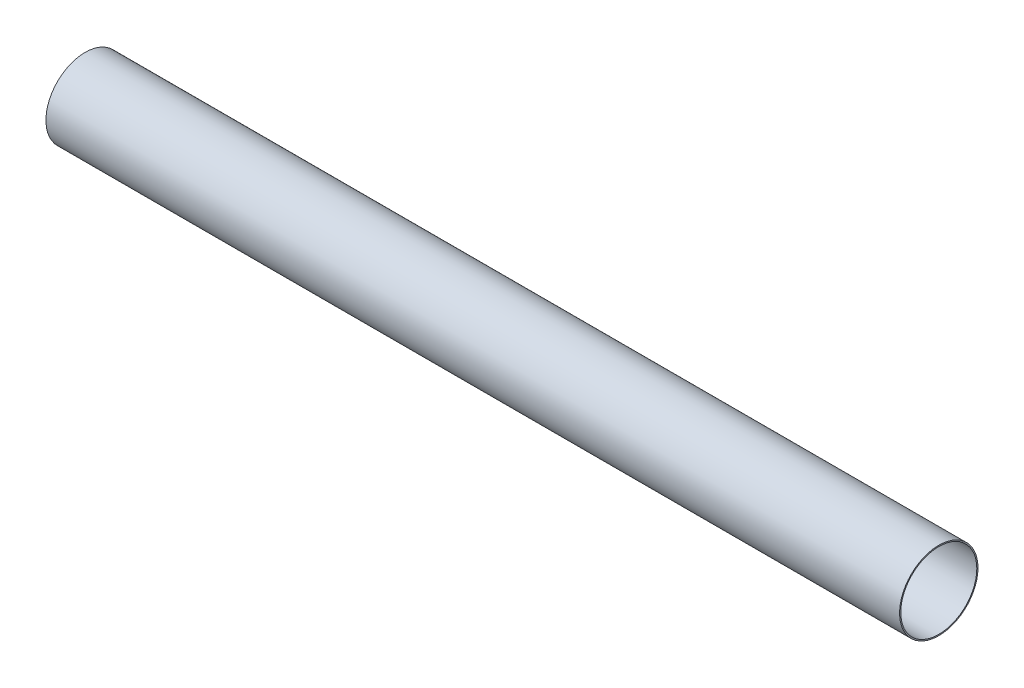
ISO-10303-21;
HEADER;
FILE_DESCRIPTION(('STEP AP214'),'2;1');
FILE_NAME('part.step','',(''),(''),'','','');
FILE_SCHEMA(('AUTOMOTIVE_DESIGN { 1 0 10303 214 1 1 1 1 }'));
ENDSEC;
DATA;
#1=APPLICATION_CONTEXT('core data for automotive mechanical design processes');
#2=APPLICATION_PROTOCOL_DEFINITION('international standard','automotive_design',2000,#1);
#3=PRODUCT_CONTEXT('',#1,'mechanical');
#4=PRODUCT('Part','Part','',(#3));
#5=PRODUCT_RELATED_PRODUCT_CATEGORY('part','',(#4));
#6=PRODUCT_DEFINITION_FORMATION('','',#4);
#7=PRODUCT_DEFINITION_CONTEXT('part definition',#1,'design');
#8=PRODUCT_DEFINITION('design','',#6,#7);
#9=PRODUCT_DEFINITION_SHAPE('','',#8);
#10=(LENGTH_UNIT() NAMED_UNIT(*) SI_UNIT(.MILLI.,.METRE.));
#11=(NAMED_UNIT(*) PLANE_ANGLE_UNIT() SI_UNIT($,.RADIAN.));
#12=(NAMED_UNIT(*) SI_UNIT($,.STERADIAN.) SOLID_ANGLE_UNIT());
#13=UNCERTAINTY_MEASURE_WITH_UNIT(LENGTH_MEASURE(1.E-05),#10,'distance_accuracy_value','');
#14=(GEOMETRIC_REPRESENTATION_CONTEXT(3) GLOBAL_UNCERTAINTY_ASSIGNED_CONTEXT((#13)) GLOBAL_UNIT_ASSIGNED_CONTEXT((#10,
#11,#12)) REPRESENTATION_CONTEXT('',''));
#15=CARTESIAN_POINT('',(0.,0.,0.));
#16=DIRECTION('',(0.,0.,1.));
#17=DIRECTION('',(1.,0.,0.));
#18=AXIS2_PLACEMENT_3D('',#15,#16,#17);
#19=CARTESIAN_POINT('',(285.115,0.,0.));
#20=DIRECTION('',(1.,0.,0.));
#21=DIRECTION('',(0.,0.,-1.));
#22=AXIS2_PLACEMENT_3D('',#19,#20,#21);
#23=PLANE('',#22);
#24=CARTESIAN_POINT('',(285.115,0.,0.));
#25=DIRECTION('',(1.,0.,0.));
#26=DIRECTION('',(0.,0.,-1.));
#27=AXIS2_PLACEMENT_3D('',#24,#25,#26);
#28=CIRCLE('',#27,26.19375);
#29=CARTESIAN_POINT('',(285.115,0.,-26.19375));
#30=VERTEX_POINT('',#29);
#31=EDGE_CURVE('E12',#30,#30,#28,.T.);
#32=ORIENTED_EDGE('',*,*,#31,.T.);
#33=EDGE_LOOP('',(#32));
#34=FACE_BOUND('',#33,.T.);
#35=CARTESIAN_POINT('',(285.115,0.,0.));
#36=DIRECTION('',(1.,0.,0.));
#37=DIRECTION('',(0.,0.,-1.));
#38=AXIS2_PLACEMENT_3D('',#35,#36,#37);
#39=CIRCLE('',#38,25.4);
#40=CARTESIAN_POINT('',(285.115,0.,-25.4));
#41=VERTEX_POINT('',#40);
#42=EDGE_CURVE('E60',#41,#41,#39,.T.);
#43=ORIENTED_EDGE('',*,*,#42,.F.);
#44=EDGE_LOOP('',(#43));
#45=FACE_BOUND('',#44,.T.);
#46=ADVANCED_FACE('F49',(#34,#45),#23,.T.);
#47=CARTESIAN_POINT('',(-285.115,0.,0.));
#48=DIRECTION('',(1.,0.,0.));
#49=DIRECTION('',(0.,0.,-1.));
#50=AXIS2_PLACEMENT_3D('',#47,#48,#49);
#51=PLANE('',#50);
#52=CARTESIAN_POINT('',(-285.115,0.,0.));
#53=DIRECTION('',(1.,0.,0.));
#54=DIRECTION('',(0.,0.,-1.));
#55=AXIS2_PLACEMENT_3D('',#52,#53,#54);
#56=CIRCLE('',#55,26.19375);
#57=CARTESIAN_POINT('',(-285.115,0.,-26.19375));
#58=VERTEX_POINT('',#57);
#59=EDGE_CURVE('E53',#58,#58,#56,.T.);
#60=ORIENTED_EDGE('',*,*,#59,.F.);
#61=EDGE_LOOP('',(#60));
#62=FACE_BOUND('',#61,.T.);
#63=CARTESIAN_POINT('',(-285.115,0.,0.));
#64=DIRECTION('',(1.,0.,0.));
#65=DIRECTION('',(0.,0.,-1.));
#66=AXIS2_PLACEMENT_3D('',#63,#64,#65);
#67=CIRCLE('',#66,25.4);
#68=CARTESIAN_POINT('',(-285.115,0.,-25.4));
#69=VERTEX_POINT('',#68);
#70=EDGE_CURVE('E62',#69,#69,#67,.T.);
#71=ORIENTED_EDGE('',*,*,#70,.T.);
#72=EDGE_LOOP('',(#71));
#73=FACE_BOUND('',#72,.T.);
#74=ADVANCED_FACE('F72',(#62,#73),#51,.F.);
#75=CARTESIAN_POINT('',(285.115,0.,0.));
#76=DIRECTION('',(-1.,0.,0.));
#77=DIRECTION('',(0.,0.,1.));
#78=AXIS2_PLACEMENT_3D('',#75,#76,#77);
#79=CYLINDRICAL_SURFACE('',#78,26.19375);
#80=ORIENTED_EDGE('',*,*,#31,.F.);
#81=EDGE_LOOP('',(#80));
#82=FACE_BOUND('',#81,.T.);
#83=ORIENTED_EDGE('',*,*,#59,.T.);
#84=EDGE_LOOP('',(#83));
#85=FACE_BOUND('',#84,.T.);
#86=ADVANCED_FACE('F51',(#82,#85),#79,.T.);
#87=CARTESIAN_POINT('',(285.115,0.,0.));
#88=DIRECTION('',(-1.,0.,0.));
#89=DIRECTION('',(0.,0.,1.));
#90=AXIS2_PLACEMENT_3D('',#87,#88,#89);
#91=CYLINDRICAL_SURFACE('',#90,25.4);
#92=ORIENTED_EDGE('',*,*,#42,.T.);
#93=EDGE_LOOP('',(#92));
#94=FACE_BOUND('',#93,.T.);
#95=ORIENTED_EDGE('',*,*,#70,.F.);
#96=EDGE_LOOP('',(#95));
#97=FACE_BOUND('',#96,.T.);
#98=ADVANCED_FACE('F68',(#94,#97),#91,.F.);
#99=CLOSED_SHELL('',(#46,#74,#86,#98));
#100=MANIFOLD_SOLID_BREP('B2',#99);
#101=ADVANCED_BREP_SHAPE_REPRESENTATION('',(#18,#100),#14);
#102=SHAPE_DEFINITION_REPRESENTATION(#9,#101);
ENDSEC;
END-ISO-10303-21;
